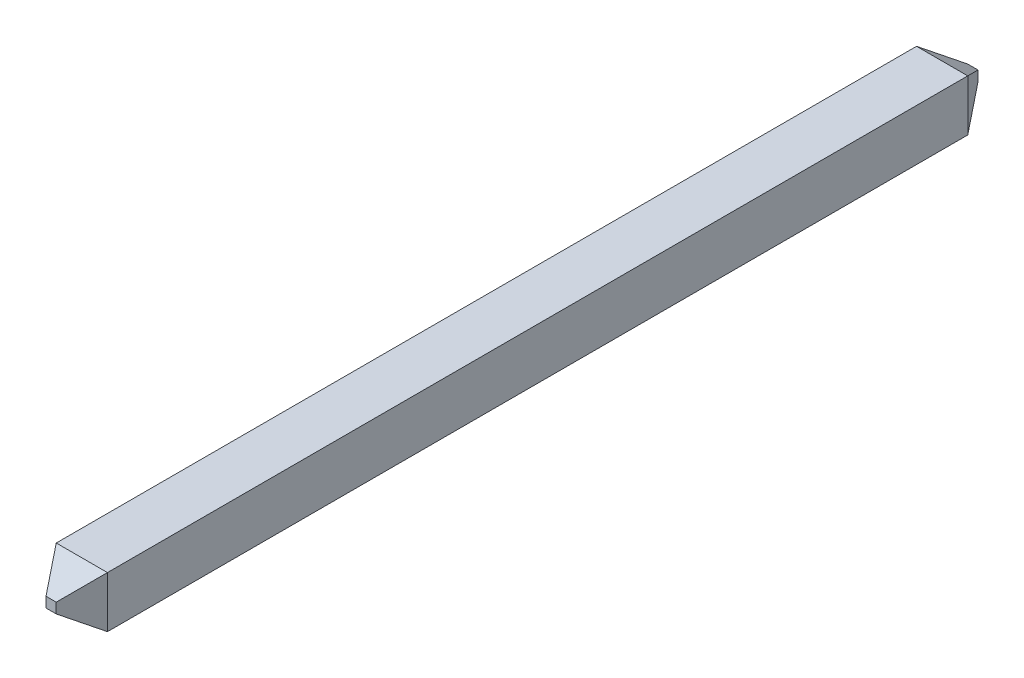
ISO-10303-21;
HEADER;
FILE_DESCRIPTION(('STEP AP214'),'2;1');
FILE_NAME('part.step','',(''),(''),'','','');
FILE_SCHEMA(('AUTOMOTIVE_DESIGN { 1 0 10303 214 1 1 1 1 }'));
ENDSEC;
DATA;
#1=APPLICATION_CONTEXT('core data for automotive mechanical design processes');
#2=APPLICATION_PROTOCOL_DEFINITION('international standard','automotive_design',2000,#1);
#3=PRODUCT_CONTEXT('',#1,'mechanical');
#4=PRODUCT('Part','Part','',(#3));
#5=PRODUCT_RELATED_PRODUCT_CATEGORY('part','',(#4));
#6=PRODUCT_DEFINITION_FORMATION('','',#4);
#7=PRODUCT_DEFINITION_CONTEXT('part definition',#1,'design');
#8=PRODUCT_DEFINITION('design','',#6,#7);
#9=PRODUCT_DEFINITION_SHAPE('','',#8);
#10=(LENGTH_UNIT() NAMED_UNIT(*) SI_UNIT(.MILLI.,.METRE.));
#11=(NAMED_UNIT(*) PLANE_ANGLE_UNIT() SI_UNIT($,.RADIAN.));
#12=(NAMED_UNIT(*) SI_UNIT($,.STERADIAN.) SOLID_ANGLE_UNIT());
#13=UNCERTAINTY_MEASURE_WITH_UNIT(LENGTH_MEASURE(1.E-05),#10,'distance_accuracy_value','');
#14=(GEOMETRIC_REPRESENTATION_CONTEXT(3) GLOBAL_UNCERTAINTY_ASSIGNED_CONTEXT((#13)) GLOBAL_UNIT_ASSIGNED_CONTEXT((#10,
#11,#12)) REPRESENTATION_CONTEXT('',''));
#15=CARTESIAN_POINT('',(0.,0.,0.));
#16=DIRECTION('',(0.,0.,1.));
#17=DIRECTION('',(1.,0.,0.));
#18=AXIS2_PLACEMENT_3D('',#15,#16,#17);
#19=CARTESIAN_POINT('',(0.,2.4765,-6.35));
#20=DIRECTION('',(0.,0.832050294337843,0.55470019622523));
#21=DIRECTION('',(0.,-0.55470019622523,0.832050294337843));
#22=AXIS2_PLACEMENT_3D('',#19,#20,#21);
#23=PLANE('',#22);
#24=DIRECTION('',(1.,0.,0.));
#25=VECTOR('',#24,1.);
#26=CARTESIAN_POINT('',(0.3175,2.2225,-5.969));
#27=LINE('',#26,#25);
#28=CARTESIAN_POINT('',(-0.3175,2.2225,-5.969));
#29=VERTEX_POINT('',#28);
#30=CARTESIAN_POINT('',(0.3175,2.2225,-5.969));
#31=VERTEX_POINT('',#30);
#32=EDGE_CURVE('E103',#29,#31,#27,.T.);
#33=ORIENTED_EDGE('',*,*,#32,.F.);
#34=DIRECTION('',(0.485071250072666,0.485071250072667,-0.727606875108998));
#35=VECTOR('',#34,1.);
#36=CARTESIAN_POINT('',(-0.3175,2.2225,-5.969));
#37=LINE('',#36,#35);
#38=CARTESIAN_POINT('',(-0.0635,2.4765,-6.35));
#39=VERTEX_POINT('',#38);
#40=EDGE_CURVE('E78',#29,#39,#37,.T.);
#41=ORIENTED_EDGE('',*,*,#40,.T.);
#42=DIRECTION('',(-1.,0.,0.));
#43=VECTOR('',#42,1.);
#44=CARTESIAN_POINT('',(0.,2.4765,-6.35));
#45=LINE('',#44,#43);
#46=CARTESIAN_POINT('',(0.0634999999999999,2.4765,-6.35));
#47=VERTEX_POINT('',#46);
#48=EDGE_CURVE('E19',#47,#39,#45,.T.);
#49=ORIENTED_EDGE('',*,*,#48,.F.);
#50=DIRECTION('',(0.485071250072666,-0.485071250072667,0.727606875108998));
#51=VECTOR('',#50,1.);
#52=CARTESIAN_POINT('',(0.0635,2.4765,-6.35));
#53=LINE('',#52,#51);
#54=EDGE_CURVE('E82',#47,#31,#53,.T.);
#55=ORIENTED_EDGE('',*,*,#54,.T.);
#56=EDGE_LOOP('',(#33,#41,#49,#55));
#57=FACE_BOUND('',#56,.T.);
#58=ADVANCED_FACE('F16',(#57),#23,.F.);
#59=CARTESIAN_POINT('',(0.3175,2.2225,4.699));
#60=DIRECTION('',(0.,-0.832050294337844,0.554700196225229));
#61=DIRECTION('',(0.,-0.554700196225229,-0.832050294337844));
#62=AXIS2_PLACEMENT_3D('',#59,#60,#61);
#63=PLANE('',#62);
#64=DIRECTION('',(0.485071250072666,0.485071250072666,0.727606875108999));
#65=VECTOR('',#64,1.);
#66=CARTESIAN_POINT('',(-0.3175,2.2225,4.699));
#67=LINE('',#66,#65);
#68=CARTESIAN_POINT('',(-0.3175,2.2225,4.699));
#69=VERTEX_POINT('',#68);
#70=CARTESIAN_POINT('',(-0.0635,2.4765,5.08));
#71=VERTEX_POINT('',#70);
#72=EDGE_CURVE('E111',#69,#71,#67,.T.);
#73=ORIENTED_EDGE('',*,*,#72,.F.);
#74=DIRECTION('',(1.,0.,0.));
#75=VECTOR('',#74,1.);
#76=CARTESIAN_POINT('',(0.3175,2.2225,4.699));
#77=LINE('',#76,#75);
#78=CARTESIAN_POINT('',(0.3175,2.2225,4.699));
#79=VERTEX_POINT('',#78);
#80=EDGE_CURVE('E105',#79,#69,#77,.F.);
#81=ORIENTED_EDGE('',*,*,#80,.F.);
#82=DIRECTION('',(0.485071250072666,-0.485071250072666,-0.727606875108999));
#83=VECTOR('',#82,1.);
#84=CARTESIAN_POINT('',(0.0635,2.4765,5.08));
#85=LINE('',#84,#83);
#86=CARTESIAN_POINT('',(0.0635,2.4765,5.08));
#87=VERTEX_POINT('',#86);
#88=EDGE_CURVE('E108',#87,#79,#85,.T.);
#89=ORIENTED_EDGE('',*,*,#88,.F.);
#90=DIRECTION('',(-1.,0.,0.));
#91=VECTOR('',#90,1.);
#92=CARTESIAN_POINT('',(0.,2.4765,5.08));
#93=LINE('',#92,#91);
#94=EDGE_CURVE('E117',#87,#71,#93,.T.);
#95=ORIENTED_EDGE('',*,*,#94,.T.);
#96=EDGE_LOOP('',(#73,#81,#89,#95));
#97=FACE_BOUND('',#96,.T.);
#98=ADVANCED_FACE('F175',(#97),#63,.T.);
#99=CARTESIAN_POINT('',(0.,0.,-6.35));
#100=DIRECTION('',(0.,0.,-1.));
#101=DIRECTION('',(-1.,0.,0.));
#102=AXIS2_PLACEMENT_3D('',#99,#100,#101);
#103=PLANE('',#102);
#104=DIRECTION('',(0.,1.,0.));
#105=VECTOR('',#104,1.);
#106=CARTESIAN_POINT('',(-0.0635,0.,-6.35));
#107=LINE('',#106,#105);
#108=CARTESIAN_POINT('',(-0.0634999999999999,2.6035,-6.35));
#109=VERTEX_POINT('',#108);
#110=EDGE_CURVE('E99',#39,#109,#107,.T.);
#111=ORIENTED_EDGE('',*,*,#110,.T.);
#112=DIRECTION('',(1.,0.,0.));
#113=VECTOR('',#112,1.);
#114=CARTESIAN_POINT('',(0.,2.6035,-6.35));
#115=LINE('',#114,#113);
#116=CARTESIAN_POINT('',(0.0635,2.6035,-6.35));
#117=VERTEX_POINT('',#116);
#118=EDGE_CURVE('E90',#109,#117,#115,.T.);
#119=ORIENTED_EDGE('',*,*,#118,.T.);
#120=DIRECTION('',(0.,1.,0.));
#121=VECTOR('',#120,1.);
#122=CARTESIAN_POINT('',(0.0635,0.,-6.35));
#123=LINE('',#122,#121);
#124=EDGE_CURVE('E86',#117,#47,#123,.F.);
#125=ORIENTED_EDGE('',*,*,#124,.T.);
#126=ORIENTED_EDGE('',*,*,#48,.T.);
#127=EDGE_LOOP('',(#111,#119,#125,#126));
#128=FACE_BOUND('',#127,.T.);
#129=ADVANCED_FACE('F88',(#128),#103,.T.);
#130=CARTESIAN_POINT('',(0.0635,0.,-6.35));
#131=DIRECTION('',(-0.832050294337843,0.,0.55470019622523));
#132=DIRECTION('',(0.55470019622523,0.,0.832050294337843));
#133=AXIS2_PLACEMENT_3D('',#130,#131,#132);
#134=PLANE('',#133);
#135=DIRECTION('',(0.,1.,0.));
#136=VECTOR('',#135,1.);
#137=CARTESIAN_POINT('',(0.3175,2.8575,-5.969));
#138=LINE('',#137,#136);
#139=CARTESIAN_POINT('',(0.3175,2.8575,-5.969));
#140=VERTEX_POINT('',#139);
#141=EDGE_CURVE('E96',#31,#140,#138,.T.);
#142=ORIENTED_EDGE('',*,*,#141,.F.);
#143=ORIENTED_EDGE('',*,*,#54,.F.);
#144=ORIENTED_EDGE('',*,*,#124,.F.);
#145=DIRECTION('',(0.485071250072666,0.485071250072667,0.727606875108998));
#146=VECTOR('',#145,1.);
#147=CARTESIAN_POINT('',(0.0635,2.6035,-6.35));
#148=LINE('',#147,#146);
#149=EDGE_CURVE('E128',#117,#140,#148,.T.);
#150=ORIENTED_EDGE('',*,*,#149,.T.);
#151=EDGE_LOOP('',(#142,#143,#144,#150));
#152=FACE_BOUND('',#151,.T.);
#153=ADVANCED_FACE('F94',(#152),#134,.F.);
#154=CARTESIAN_POINT('',(-0.0635,0.,-6.35));
#155=DIRECTION('',(0.832050294337843,0.,0.55470019622523));
#156=DIRECTION('',(0.55470019622523,0.,-0.832050294337843));
#157=AXIS2_PLACEMENT_3D('',#154,#155,#156);
#158=PLANE('',#157);
#159=ORIENTED_EDGE('',*,*,#110,.F.);
#160=ORIENTED_EDGE('',*,*,#40,.F.);
#161=DIRECTION('',(0.,1.,0.));
#162=VECTOR('',#161,1.);
#163=CARTESIAN_POINT('',(-0.3175,2.2225,-5.969));
#164=LINE('',#163,#162);
#165=CARTESIAN_POINT('',(-0.3175,2.8575,-5.969));
#166=VERTEX_POINT('',#165);
#167=EDGE_CURVE('E133',#166,#29,#164,.F.);
#168=ORIENTED_EDGE('',*,*,#167,.F.);
#169=DIRECTION('',(0.485071250072666,-0.485071250072667,-0.727606875108998));
#170=VECTOR('',#169,1.);
#171=CARTESIAN_POINT('',(-0.3175,2.8575,-5.969));
#172=LINE('',#171,#170);
#173=EDGE_CURVE('E130',#166,#109,#172,.T.);
#174=ORIENTED_EDGE('',*,*,#173,.T.);
#175=EDGE_LOOP('',(#159,#160,#168,#174));
#176=FACE_BOUND('',#175,.T.);
#177=ADVANCED_FACE('F208',(#176),#158,.F.);
#178=CARTESIAN_POINT('',(0.3175,2.2225,5.08));
#179=DIRECTION('',(0.,-1.,0.));
#180=DIRECTION('',(0.,0.,-1.));
#181=AXIS2_PLACEMENT_3D('',#178,#179,#180);
#182=PLANE('',#181);
#183=DIRECTION('',(0.,0.,-1.));
#184=VECTOR('',#183,1.);
#185=CARTESIAN_POINT('',(0.3175,2.2225,5.08));
#186=LINE('',#185,#184);
#187=EDGE_CURVE('E121',#79,#31,#186,.T.);
#188=ORIENTED_EDGE('',*,*,#187,.F.);
#189=ORIENTED_EDGE('',*,*,#80,.T.);
#190=DIRECTION('',(0.,0.,1.));
#191=VECTOR('',#190,1.);
#192=CARTESIAN_POINT('',(-0.3175,2.2225,5.08));
#193=LINE('',#192,#191);
#194=EDGE_CURVE('E136',#29,#69,#193,.T.);
#195=ORIENTED_EDGE('',*,*,#194,.F.);
#196=ORIENTED_EDGE('',*,*,#32,.T.);
#197=EDGE_LOOP('',(#188,#189,#195,#196));
#198=FACE_BOUND('',#197,.T.);
#199=ADVANCED_FACE('F186',(#198),#182,.T.);
#200=CARTESIAN_POINT('',(0.3175,2.8575,4.699));
#201=DIRECTION('',(0.832050294337844,0.,0.554700196225229));
#202=DIRECTION('',(0.554700196225229,0.,-0.832050294337844));
#203=AXIS2_PLACEMENT_3D('',#200,#201,#202);
#204=PLANE('',#203);
#205=ORIENTED_EDGE('',*,*,#88,.T.);
#206=DIRECTION('',(0.,1.,0.));
#207=VECTOR('',#206,1.);
#208=CARTESIAN_POINT('',(0.3175,2.8575,4.699));
#209=LINE('',#208,#207);
#210=CARTESIAN_POINT('',(0.3175,2.8575,4.699));
#211=VERTEX_POINT('',#210);
#212=EDGE_CURVE('E124',#211,#79,#209,.F.);
#213=ORIENTED_EDGE('',*,*,#212,.F.);
#214=DIRECTION('',(0.485071250072666,0.485071250072666,-0.727606875108999));
#215=VECTOR('',#214,1.);
#216=CARTESIAN_POINT('',(0.0635,2.6035,5.08));
#217=LINE('',#216,#215);
#218=CARTESIAN_POINT('',(0.0635,2.6035,5.08));
#219=VERTEX_POINT('',#218);
#220=EDGE_CURVE('E141',#219,#211,#217,.T.);
#221=ORIENTED_EDGE('',*,*,#220,.F.);
#222=DIRECTION('',(0.,1.,0.));
#223=VECTOR('',#222,1.);
#224=CARTESIAN_POINT('',(0.0635,0.,5.08));
#225=LINE('',#224,#223);
#226=EDGE_CURVE('E114',#219,#87,#225,.F.);
#227=ORIENTED_EDGE('',*,*,#226,.T.);
#228=EDGE_LOOP('',(#205,#213,#221,#227));
#229=FACE_BOUND('',#228,.T.);
#230=ADVANCED_FACE('F168',(#229),#204,.T.);
#231=CARTESIAN_POINT('',(-0.3175,2.2225,4.699));
#232=DIRECTION('',(-0.832050294337844,0.,0.554700196225229));
#233=DIRECTION('',(0.554700196225229,0.,0.832050294337844));
#234=AXIS2_PLACEMENT_3D('',#231,#232,#233);
#235=PLANE('',#234);
#236=DIRECTION('',(0.485071250072666,-0.485071250072666,0.727606875108999));
#237=VECTOR('',#236,1.);
#238=CARTESIAN_POINT('',(-0.3175,2.8575,4.699));
#239=LINE('',#238,#237);
#240=CARTESIAN_POINT('',(-0.3175,2.8575,4.699));
#241=VERTEX_POINT('',#240);
#242=CARTESIAN_POINT('',(-0.0635,2.6035,5.08));
#243=VERTEX_POINT('',#242);
#244=EDGE_CURVE('E34',#241,#243,#239,.T.);
#245=ORIENTED_EDGE('',*,*,#244,.F.);
#246=DIRECTION('',(0.,1.,0.));
#247=VECTOR('',#246,1.);
#248=CARTESIAN_POINT('',(-0.3175,2.2225,4.699));
#249=LINE('',#248,#247);
#250=EDGE_CURVE('E139',#69,#241,#249,.T.);
#251=ORIENTED_EDGE('',*,*,#250,.F.);
#252=ORIENTED_EDGE('',*,*,#72,.T.);
#253=DIRECTION('',(0.,1.,0.));
#254=VECTOR('',#253,1.);
#255=CARTESIAN_POINT('',(-0.0635,0.,5.08));
#256=LINE('',#255,#254);
#257=EDGE_CURVE('E119',#71,#243,#256,.T.);
#258=ORIENTED_EDGE('',*,*,#257,.T.);
#259=EDGE_LOOP('',(#245,#251,#252,#258));
#260=FACE_BOUND('',#259,.T.);
#261=ADVANCED_FACE('F176',(#260),#235,.T.);
#262=CARTESIAN_POINT('',(0.,0.,5.08));
#263=DIRECTION('',(0.,0.,-1.));
#264=DIRECTION('',(-1.,0.,0.));
#265=AXIS2_PLACEMENT_3D('',#262,#263,#264);
#266=PLANE('',#265);
#267=ORIENTED_EDGE('',*,*,#257,.F.);
#268=ORIENTED_EDGE('',*,*,#94,.F.);
#269=ORIENTED_EDGE('',*,*,#226,.F.);
#270=DIRECTION('',(1.,0.,0.));
#271=VECTOR('',#270,1.);
#272=CARTESIAN_POINT('',(-0.3175,2.6035,5.08));
#273=LINE('',#272,#271);
#274=EDGE_CURVE('E145',#243,#219,#273,.T.);
#275=ORIENTED_EDGE('',*,*,#274,.F.);
#276=EDGE_LOOP('',(#267,#268,#269,#275));
#277=FACE_BOUND('',#276,.T.);
#278=ADVANCED_FACE('F173',(#277),#266,.F.);
#279=CARTESIAN_POINT('',(0.3175,2.8575,5.08));
#280=DIRECTION('',(1.,0.,0.));
#281=DIRECTION('',(0.,0.,-1.));
#282=AXIS2_PLACEMENT_3D('',#279,#280,#281);
#283=PLANE('',#282);
#284=DIRECTION('',(0.,0.,1.));
#285=VECTOR('',#284,1.);
#286=CARTESIAN_POINT('',(0.3175,2.8575,5.08));
#287=LINE('',#286,#285);
#288=EDGE_CURVE('E148',#211,#140,#287,.F.);
#289=ORIENTED_EDGE('',*,*,#288,.F.);
#290=ORIENTED_EDGE('',*,*,#212,.T.);
#291=ORIENTED_EDGE('',*,*,#187,.T.);
#292=ORIENTED_EDGE('',*,*,#141,.T.);
#293=EDGE_LOOP('',(#289,#290,#291,#292));
#294=FACE_BOUND('',#293,.T.);
#295=ADVANCED_FACE('F184',(#294),#283,.T.);
#296=CARTESIAN_POINT('',(0.,2.6035,-6.35));
#297=DIRECTION('',(0.,-0.832050294337843,0.55470019622523));
#298=DIRECTION('',(0.,-0.55470019622523,-0.832050294337843));
#299=AXIS2_PLACEMENT_3D('',#296,#297,#298);
#300=PLANE('',#299);
#301=DIRECTION('',(1.,0.,0.));
#302=VECTOR('',#301,1.);
#303=CARTESIAN_POINT('',(-0.3175,2.8575,-5.969));
#304=LINE('',#303,#302);
#305=EDGE_CURVE('E151',#140,#166,#304,.F.);
#306=ORIENTED_EDGE('',*,*,#305,.F.);
#307=ORIENTED_EDGE('',*,*,#149,.F.);
#308=ORIENTED_EDGE('',*,*,#118,.F.);
#309=ORIENTED_EDGE('',*,*,#173,.F.);
#310=EDGE_LOOP('',(#306,#307,#308,#309));
#311=FACE_BOUND('',#310,.T.);
#312=ADVANCED_FACE('F197',(#311),#300,.F.);
#313=CARTESIAN_POINT('',(-0.3175,2.2225,5.08));
#314=DIRECTION('',(-1.,0.,0.));
#315=DIRECTION('',(0.,0.,1.));
#316=AXIS2_PLACEMENT_3D('',#313,#314,#315);
#317=PLANE('',#316);
#318=ORIENTED_EDGE('',*,*,#194,.T.);
#319=ORIENTED_EDGE('',*,*,#250,.T.);
#320=DIRECTION('',(0.,0.,1.));
#321=VECTOR('',#320,1.);
#322=CARTESIAN_POINT('',(-0.3175,2.8575,5.08));
#323=LINE('',#322,#321);
#324=EDGE_CURVE('E25',#166,#241,#323,.T.);
#325=ORIENTED_EDGE('',*,*,#324,.F.);
#326=ORIENTED_EDGE('',*,*,#167,.T.);
#327=EDGE_LOOP('',(#318,#319,#325,#326));
#328=FACE_BOUND('',#327,.T.);
#329=ADVANCED_FACE('F161',(#328),#317,.T.);
#330=CARTESIAN_POINT('',(-0.3175,2.8575,4.699));
#331=DIRECTION('',(0.,0.832050294337844,0.554700196225229));
#332=DIRECTION('',(0.,-0.554700196225229,0.832050294337844));
#333=AXIS2_PLACEMENT_3D('',#330,#331,#332);
#334=PLANE('',#333);
#335=ORIENTED_EDGE('',*,*,#244,.T.);
#336=ORIENTED_EDGE('',*,*,#274,.T.);
#337=ORIENTED_EDGE('',*,*,#220,.T.);
#338=DIRECTION('',(1.,0.,0.));
#339=VECTOR('',#338,1.);
#340=CARTESIAN_POINT('',(-0.3175,2.8575,4.699));
#341=LINE('',#340,#339);
#342=EDGE_CURVE('E11',#241,#211,#341,.T.);
#343=ORIENTED_EDGE('',*,*,#342,.F.);
#344=EDGE_LOOP('',(#335,#336,#337,#343));
#345=FACE_BOUND('',#344,.T.);
#346=ADVANCED_FACE('F164',(#345),#334,.T.);
#347=CARTESIAN_POINT('',(-0.3175,2.8575,5.08));
#348=DIRECTION('',(0.,1.,0.));
#349=DIRECTION('',(0.,0.,1.));
#350=AXIS2_PLACEMENT_3D('',#347,#348,#349);
#351=PLANE('',#350);
#352=ORIENTED_EDGE('',*,*,#324,.T.);
#353=ORIENTED_EDGE('',*,*,#342,.T.);
#354=ORIENTED_EDGE('',*,*,#288,.T.);
#355=ORIENTED_EDGE('',*,*,#305,.T.);
#356=EDGE_LOOP('',(#352,#353,#354,#355));
#357=FACE_BOUND('',#356,.T.);
#358=ADVANCED_FACE('F157',(#357),#351,.T.);
#359=CLOSED_SHELL('',(#58,#98,#129,#153,#177,#199,#230,#261,#278,#295,#312,#329,#346,#358));
#360=MANIFOLD_SOLID_BREP('B1',#359);
#361=ADVANCED_BREP_SHAPE_REPRESENTATION('',(#18,#360),#14);
#362=SHAPE_DEFINITION_REPRESENTATION(#9,#361);
ENDSEC;
END-ISO-10303-21;
